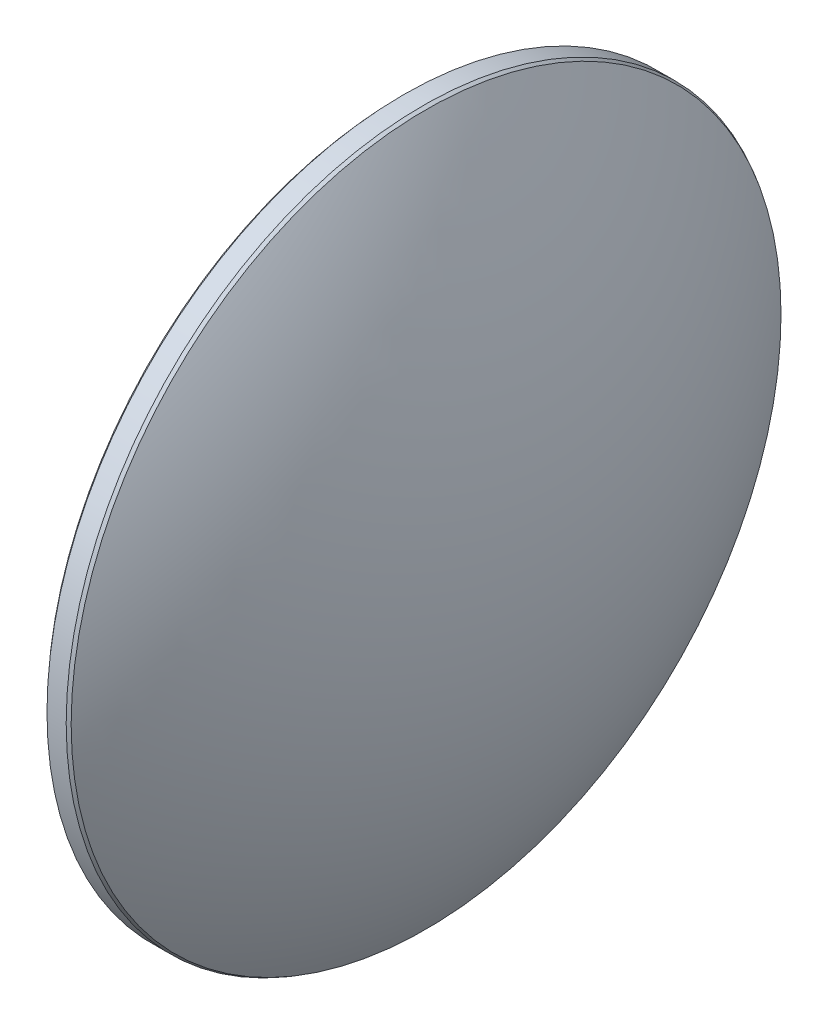
ISO-10303-21;
HEADER;
FILE_DESCRIPTION(('STEP AP214'),'2;1');
FILE_NAME('part.step','',(''),(''),'','','');
FILE_SCHEMA(('AUTOMOTIVE_DESIGN { 1 0 10303 214 1 1 1 1 }'));
ENDSEC;
DATA;
#1=APPLICATION_CONTEXT('core data for automotive mechanical design processes');
#2=APPLICATION_PROTOCOL_DEFINITION('international standard','automotive_design',2000,#1);
#3=PRODUCT_CONTEXT('',#1,'mechanical');
#4=PRODUCT('Part','Part','',(#3));
#5=PRODUCT_RELATED_PRODUCT_CATEGORY('part','',(#4));
#6=PRODUCT_DEFINITION_FORMATION('','',#4);
#7=PRODUCT_DEFINITION_CONTEXT('part definition',#1,'design');
#8=PRODUCT_DEFINITION('design','',#6,#7);
#9=PRODUCT_DEFINITION_SHAPE('','',#8);
#10=(LENGTH_UNIT() NAMED_UNIT(*) SI_UNIT(.MILLI.,.METRE.));
#11=(NAMED_UNIT(*) PLANE_ANGLE_UNIT() SI_UNIT($,.RADIAN.));
#12=(NAMED_UNIT(*) SI_UNIT($,.STERADIAN.) SOLID_ANGLE_UNIT());
#13=UNCERTAINTY_MEASURE_WITH_UNIT(LENGTH_MEASURE(1.E-05),#10,'distance_accuracy_value','');
#14=(GEOMETRIC_REPRESENTATION_CONTEXT(3) GLOBAL_UNCERTAINTY_ASSIGNED_CONTEXT((#13)) GLOBAL_UNIT_ASSIGNED_CONTEXT((#10,
#11,#12)) REPRESENTATION_CONTEXT('',''));
#15=CARTESIAN_POINT('',(0.,0.,0.));
#16=DIRECTION('',(0.,0.,1.));
#17=DIRECTION('',(1.,0.,0.));
#18=AXIS2_PLACEMENT_3D('',#15,#16,#17);
#19=CARTESIAN_POINT('',(-298.69047517418,0.,-7.88998102962957E-08));
#20=DIRECTION('',(0.,1.,0.));
#21=DIRECTION('',(0.995586967395581,0.,0.0938434353168646));
#22=AXIS2_PLACEMENT_3D('',#19,#20,#21);
#23=SPHERICAL_SURFACE('',#22,299.999999940449);
#24=CARTESIAN_POINT('',(-298.69047517418,0.,-7.88998102962957E-08));
#25=DIRECTION('',(1.,0.,0.));
#26=DIRECTION('',(0.,0.,-1.));
#27=AXIS2_PLACEMENT_3D('',#24,#25,#26);
#28=SPHERICAL_SURFACE('',#27,299.999999940449);
#29=CARTESIAN_POINT('',(0.0305464990000253,0.,0.));
#30=DIRECTION('',(1.,0.,0.));
#31=DIRECTION('',(0.,0.,-1.));
#32=AXIS2_PLACEMENT_3D('',#29,#30,#31);
#33=CIRCLE('',#32,27.6722093490001);
#34=CARTESIAN_POINT('',(0.0305464990000253,0.,-27.6722093490001));
#35=VERTEX_POINT('',#34);
#36=EDGE_CURVE('E18',#35,#35,#33,.F.);
#37=ORIENTED_EDGE('',*,*,#36,.T.);
#38=EDGE_LOOP('',(#37));
#39=FACE_BOUND('',#38,.T.);
#40=ADVANCED_FACE('F15',(#39),#28,.F.);
#41=CARTESIAN_POINT('',(0.030546499,0.,0.));
#42=DIRECTION('',(1.,0.,0.));
#43=DIRECTION('',(0.,0.,-1.));
#44=AXIS2_PLACEMENT_3D('',#41,#42,#43);
#45=CONICAL_SURFACE('',#44,27.672209349,0.831582017065546);
#46=ORIENTED_EDGE('',*,*,#36,.F.);
#47=EDGE_LOOP('',(#46));
#48=FACE_BOUND('',#47,.T.);
#49=CARTESIAN_POINT('',(0.329376787000001,0.,0.));
#50=DIRECTION('',(-1.,0.,0.));
#51=DIRECTION('',(0.,0.,1.));
#52=AXIS2_PLACEMENT_3D('',#49,#50,#51);
#53=CIRCLE('',#52,28.);
#54=CARTESIAN_POINT('',(0.329376787,0.,28.));
#55=VERTEX_POINT('',#54);
#56=EDGE_CURVE('E26',#55,#55,#53,.T.);
#57=ORIENTED_EDGE('',*,*,#56,.T.);
#58=EDGE_LOOP('',(#57));
#59=FACE_BOUND('',#58,.T.);
#60=ADVANCED_FACE('F36',(#48,#59),#45,.T.);
#61=CARTESIAN_POINT('',(1.836764133,0.,0.));
#62=DIRECTION('',(-1.,0.,0.));
#63=DIRECTION('',(0.,0.,1.));
#64=AXIS2_PLACEMENT_3D('',#61,#62,#63);
#65=CYLINDRICAL_SURFACE('',#64,28.);
#66=CARTESIAN_POINT('',(1.83676413299993,0.,0.));
#67=DIRECTION('',(-1.,0.,0.));
#68=DIRECTION('',(0.,0.,1.));
#69=AXIS2_PLACEMENT_3D('',#66,#67,#68);
#70=CIRCLE('',#69,28.);
#71=CARTESIAN_POINT('',(1.836764133,0.,28.));
#72=VERTEX_POINT('',#71);
#73=EDGE_CURVE('E22',#72,#72,#70,.T.);
#74=ORIENTED_EDGE('',*,*,#73,.T.);
#75=EDGE_LOOP('',(#74));
#76=FACE_BOUND('',#75,.T.);
#77=ORIENTED_EDGE('',*,*,#56,.F.);
#78=EDGE_LOOP('',(#77));
#79=FACE_BOUND('',#78,.T.);
#80=ADVANCED_FACE('F38',(#76,#79),#65,.T.);
#81=CARTESIAN_POINT('',(-5.205715347,28.158811493,23.646120188));
#82=CARTESIAN_POINT('',(4.557081562,28.158811493,8.85943408600001));
#83=CARTESIAN_POINT('',(4.557081562,28.158811493,-8.85943408700001));
#84=CARTESIAN_POINT('',(-5.205715347,28.158811493,-23.646120188));
#85=CARTESIAN_POINT('',(4.442781644,10.537749321,30.01646686));
#86=CARTESIAN_POINT('',(16.835709851,10.537749321,11.246196312));
#87=CARTESIAN_POINT('',(16.835709851,10.537749321,-11.246196312));
#88=CARTESIAN_POINT('',(4.442781644,10.537749321,-30.01646686));
#89=CARTESIAN_POINT('',(4.442781644,-10.537749321,30.01646686));
#90=CARTESIAN_POINT('',(16.835709851,-10.537749321,11.246196312));
#91=CARTESIAN_POINT('',(16.835709851,-10.537749321,-11.246196312));
#92=CARTESIAN_POINT('',(4.442781644,-10.537749321,-30.01646686));
#93=CARTESIAN_POINT('',(-5.205715347,-28.158811493,23.646120188));
#94=CARTESIAN_POINT('',(4.557081562,-28.158811493,8.85943408600001));
#95=CARTESIAN_POINT('',(4.557081562,-28.158811493,-8.85943408700001));
#96=CARTESIAN_POINT('',(-5.205715347,-28.158811493,-23.646120188));
#97=(BOUNDED_SURFACE() B_SPLINE_SURFACE(3,3,((#81,#82,#83,#84),(#85,#86,#87,#88),(#89,#90,#91,
#92),(#93,#94,#95,#96)),.UNSPECIFIED.,.F.,.F.,.F.) B_SPLINE_SURFACE_WITH_KNOTS((4,4),(4,4),(0.,
1.),(0.,1.),.UNSPECIFIED.) GEOMETRIC_REPRESENTATION_ITEM() RATIONAL_B_SPLINE_SURFACE(((1.,
0.889677600799427,0.889677600799427,1.),(0.890728201243719,0.792460929046901,0.792460929046901,
0.890728201243719),(0.890728201243719,0.792460929046901,0.792460929046901,0.890728201243719),
(1.,0.889677600799427,0.889677600799427,1.))) REPRESENTATION_ITEM('') SURFACE());
#98=CARTESIAN_POINT('',(2.08908573400002,0.,0.));
#99=DIRECTION('',(-1.,0.,0.));
#100=DIRECTION('',(0.,0.,1.));
#101=AXIS2_PLACEMENT_3D('',#98,#99,#100);
#102=CIRCLE('',#101,27.862647471);
#103=CARTESIAN_POINT('',(2.08908573400002,0.,27.862647471));
#104=VERTEX_POINT('',#103);
#105=EDGE_CURVE('E10',#104,#104,#102,.F.);
#106=ORIENTED_EDGE('',*,*,#105,.T.);
#107=EDGE_LOOP('',(#106));
#108=FACE_BOUND('',#107,.T.);
#109=ADVANCED_FACE('F44',(#108),#97,.T.);
#110=CARTESIAN_POINT('',(2.089085734,0.,0.));
#111=DIRECTION('',(-1.,0.,0.));
#112=DIRECTION('',(0.,0.,1.));
#113=AXIS2_PLACEMENT_3D('',#110,#111,#112);
#114=CONICAL_SURFACE('',#113,27.862647471,0.498498921502985);
#115=ORIENTED_EDGE('',*,*,#105,.F.);
#116=EDGE_LOOP('',(#115));
#117=FACE_BOUND('',#116,.T.);
#118=ORIENTED_EDGE('',*,*,#73,.F.);
#119=EDGE_LOOP('',(#118));
#120=FACE_BOUND('',#119,.T.);
#121=ADVANCED_FACE('F47',(#117,#120),#114,.T.);
#122=CLOSED_SHELL('',(#40,#60,#80,#109,#121));
#123=MANIFOLD_SOLID_BREP('B1',#122);
#124=ADVANCED_BREP_SHAPE_REPRESENTATION('',(#18,#123),#14);
#125=SHAPE_DEFINITION_REPRESENTATION(#9,#124);
ENDSEC;
END-ISO-10303-21;
